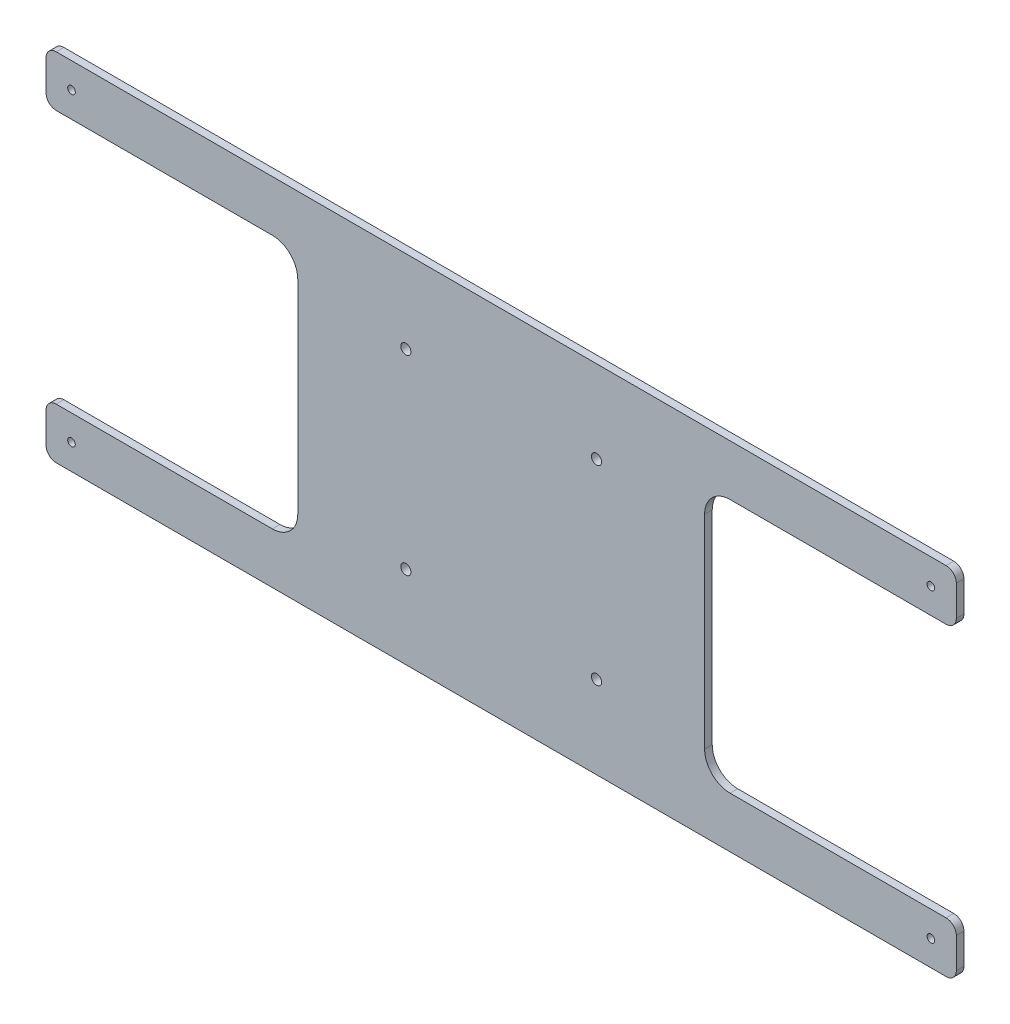
ISO-10303-21;
HEADER;
FILE_DESCRIPTION(('STEP AP214'),'2;1');
FILE_NAME('part.step','',(''),(''),'','','');
FILE_SCHEMA(('AUTOMOTIVE_DESIGN { 1 0 10303 214 1 1 1 1 }'));
ENDSEC;
DATA;
#1=APPLICATION_CONTEXT('core data for automotive mechanical design processes');
#2=APPLICATION_PROTOCOL_DEFINITION('international standard','automotive_design',2000,#1);
#3=PRODUCT_CONTEXT('',#1,'mechanical');
#4=PRODUCT('Part','Part','',(#3));
#5=PRODUCT_RELATED_PRODUCT_CATEGORY('part','',(#4));
#6=PRODUCT_DEFINITION_FORMATION('','',#4);
#7=PRODUCT_DEFINITION_CONTEXT('part definition',#1,'design');
#8=PRODUCT_DEFINITION('design','',#6,#7);
#9=PRODUCT_DEFINITION_SHAPE('','',#8);
#10=(LENGTH_UNIT() NAMED_UNIT(*) SI_UNIT(.MILLI.,.METRE.));
#11=(NAMED_UNIT(*) PLANE_ANGLE_UNIT() SI_UNIT($,.RADIAN.));
#12=(NAMED_UNIT(*) SI_UNIT($,.STERADIAN.) SOLID_ANGLE_UNIT());
#13=UNCERTAINTY_MEASURE_WITH_UNIT(LENGTH_MEASURE(1.E-05),#10,'distance_accuracy_value','');
#14=(GEOMETRIC_REPRESENTATION_CONTEXT(3) GLOBAL_UNCERTAINTY_ASSIGNED_CONTEXT((#13)) GLOBAL_UNIT_ASSIGNED_CONTEXT((#10,
#11,#12)) REPRESENTATION_CONTEXT('',''));
#15=CARTESIAN_POINT('',(0.,0.,0.));
#16=DIRECTION('',(0.,0.,1.));
#17=DIRECTION('',(1.,0.,0.));
#18=AXIS2_PLACEMENT_3D('',#15,#16,#17);
#19=CARTESIAN_POINT('',(0.,0.,3.));
#20=DIRECTION('',(0.,0.,1.));
#21=DIRECTION('',(1.,0.,0.));
#22=AXIS2_PLACEMENT_3D('',#19,#20,#21);
#23=PLANE('',#22);
#24=CARTESIAN_POINT('',(-37.5,-37.5,3.));
#25=DIRECTION('',(0.,0.,1.));
#26=DIRECTION('',(-1.,0.,0.));
#27=AXIS2_PLACEMENT_3D('',#24,#25,#26);
#28=CIRCLE('',#27,2.);
#29=CARTESIAN_POINT('',(-39.5,-37.5,3.));
#30=VERTEX_POINT('',#29);
#31=EDGE_CURVE('E447',#30,#30,#28,.T.);
#32=ORIENTED_EDGE('',*,*,#31,.F.);
#33=EDGE_LOOP('',(#32));
#34=FACE_BOUND('',#33,.T.);
#35=CARTESIAN_POINT('',(169.,-59.9999999999999,3.));
#36=DIRECTION('',(0.,0.,1.));
#37=DIRECTION('',(1.,0.,0.));
#38=AXIS2_PLACEMENT_3D('',#35,#36,#37);
#39=CIRCLE('',#38,1.5);
#40=CARTESIAN_POINT('',(170.5,-59.9999999999999,3.));
#41=VERTEX_POINT('',#40);
#42=EDGE_CURVE('E435',#41,#41,#39,.T.);
#43=ORIENTED_EDGE('',*,*,#42,.F.);
#44=EDGE_LOOP('',(#43));
#45=FACE_BOUND('',#44,.T.);
#46=CARTESIAN_POINT('',(37.5,37.5,3.));
#47=DIRECTION('',(0.,0.,1.));
#48=DIRECTION('',(-1.,0.,0.));
#49=AXIS2_PLACEMENT_3D('',#46,#47,#48);
#50=CIRCLE('',#49,2.);
#51=CARTESIAN_POINT('',(35.5,37.5,3.));
#52=VERTEX_POINT('',#51);
#53=EDGE_CURVE('E423',#52,#52,#50,.T.);
#54=ORIENTED_EDGE('',*,*,#53,.F.);
#55=EDGE_LOOP('',(#54));
#56=FACE_BOUND('',#55,.T.);
#57=CARTESIAN_POINT('',(-169.,60.,3.));
#58=DIRECTION('',(0.,0.,1.));
#59=DIRECTION('',(1.,0.,0.));
#60=AXIS2_PLACEMENT_3D('',#57,#58,#59);
#61=CIRCLE('',#60,1.5);
#62=CARTESIAN_POINT('',(-167.5,60.,3.));
#63=VERTEX_POINT('',#62);
#64=EDGE_CURVE('E376',#63,#63,#61,.T.);
#65=ORIENTED_EDGE('',*,*,#64,.F.);
#66=EDGE_LOOP('',(#65));
#67=FACE_BOUND('',#66,.T.);
#68=DIRECTION('',(1.,0.,0.));
#69=VECTOR('',#68,1.);
#70=CARTESIAN_POINT('',(-164.552800631142,-70.,3.));
#71=LINE('',#70,#69);
#72=CARTESIAN_POINT('',(-175.,-69.9999999999999,3.));
#73=VERTEX_POINT('',#72);
#74=CARTESIAN_POINT('',(175.,-70.000000000001,3.));
#75=VERTEX_POINT('',#74);
#76=EDGE_CURVE('E366',#73,#75,#71,.T.);
#77=ORIENTED_EDGE('',*,*,#76,.T.);
#78=CARTESIAN_POINT('',(175.,-65.9999999999999,3.));
#79=DIRECTION('',(0.,0.,1.));
#80=DIRECTION('',(1.,0.,0.));
#81=AXIS2_PLACEMENT_3D('',#78,#79,#80);
#82=CIRCLE('',#81,4.);
#83=CARTESIAN_POINT('',(179.,-65.9999999999999,3.));
#84=VERTEX_POINT('',#83);
#85=EDGE_CURVE('E273',#75,#84,#82,.T.);
#86=ORIENTED_EDGE('',*,*,#85,.T.);
#87=DIRECTION('',(0.,1.,0.));
#88=VECTOR('',#87,1.);
#89=CARTESIAN_POINT('',(179.,-69.9999999999999,3.));
#90=LINE('',#89,#88);
#91=CARTESIAN_POINT('',(179.,-53.9999999999999,3.));
#92=VERTEX_POINT('',#91);
#93=EDGE_CURVE('E214',#84,#92,#90,.T.);
#94=ORIENTED_EDGE('',*,*,#93,.T.);
#95=CARTESIAN_POINT('',(175.,-53.9999999999999,3.));
#96=DIRECTION('',(0.,0.,1.));
#97=DIRECTION('',(1.,0.,0.));
#98=AXIS2_PLACEMENT_3D('',#95,#96,#97);
#99=CIRCLE('',#98,4.);
#100=CARTESIAN_POINT('',(175.,-49.9999999999999,3.));
#101=VERTEX_POINT('',#100);
#102=EDGE_CURVE('E271',#92,#101,#99,.T.);
#103=ORIENTED_EDGE('',*,*,#102,.T.);
#104=DIRECTION('',(-1.,0.,0.));
#105=VECTOR('',#104,1.);
#106=CARTESIAN_POINT('',(179.,-49.9999999999999,3.));
#107=LINE('',#106,#105);
#108=CARTESIAN_POINT('',(90.,-49.9999999999999,3.));
#109=VERTEX_POINT('',#108);
#110=EDGE_CURVE('E361',#101,#109,#107,.T.);
#111=ORIENTED_EDGE('',*,*,#110,.T.);
#112=CARTESIAN_POINT('',(90.,-39.9999999999999,3.));
#113=DIRECTION('',(0.,0.,1.));
#114=DIRECTION('',(1.,0.,0.));
#115=AXIS2_PLACEMENT_3D('',#112,#113,#114);
#116=CIRCLE('',#115,10.);
#117=CARTESIAN_POINT('',(80.,-39.9999999999999,3.));
#118=VERTEX_POINT('',#117);
#119=EDGE_CURVE('E11',#109,#118,#116,.F.);
#120=ORIENTED_EDGE('',*,*,#119,.T.);
#121=DIRECTION('',(0.,1.,0.));
#122=VECTOR('',#121,1.);
#123=CARTESIAN_POINT('',(80.,49.9999999999999,3.));
#124=LINE('',#123,#122);
#125=CARTESIAN_POINT('',(80.,39.9999999999999,3.));
#126=VERTEX_POINT('',#125);
#127=EDGE_CURVE('E345',#118,#126,#124,.T.);
#128=ORIENTED_EDGE('',*,*,#127,.T.);
#129=CARTESIAN_POINT('',(90.,39.9999999999999,3.));
#130=DIRECTION('',(0.,0.,1.));
#131=DIRECTION('',(1.,0.,0.));
#132=AXIS2_PLACEMENT_3D('',#129,#130,#131);
#133=CIRCLE('',#132,10.);
#134=CARTESIAN_POINT('',(90.,49.9999999999999,3.));
#135=VERTEX_POINT('',#134);
#136=EDGE_CURVE('E336',#126,#135,#133,.F.);
#137=ORIENTED_EDGE('',*,*,#136,.T.);
#138=DIRECTION('',(1.,0.,0.));
#139=VECTOR('',#138,1.);
#140=CARTESIAN_POINT('',(179.,50.,3.));
#141=LINE('',#140,#139);
#142=CARTESIAN_POINT('',(175.,50.,3.));
#143=VERTEX_POINT('',#142);
#144=EDGE_CURVE('E343',#135,#143,#141,.T.);
#145=ORIENTED_EDGE('',*,*,#144,.T.);
#146=CARTESIAN_POINT('',(175.,54.,3.));
#147=DIRECTION('',(0.,0.,1.));
#148=DIRECTION('',(1.,0.,0.));
#149=AXIS2_PLACEMENT_3D('',#146,#147,#148);
#150=CIRCLE('',#149,4.);
#151=CARTESIAN_POINT('',(179.,54.,3.));
#152=VERTEX_POINT('',#151);
#153=EDGE_CURVE('E269',#143,#152,#150,.T.);
#154=ORIENTED_EDGE('',*,*,#153,.T.);
#155=DIRECTION('',(0.,1.,0.));
#156=VECTOR('',#155,1.);
#157=CARTESIAN_POINT('',(179.,70.,3.));
#158=LINE('',#157,#156);
#159=CARTESIAN_POINT('',(179.,66.,3.));
#160=VERTEX_POINT('',#159);
#161=EDGE_CURVE('E240',#152,#160,#158,.T.);
#162=ORIENTED_EDGE('',*,*,#161,.T.);
#163=CARTESIAN_POINT('',(175.,66.,3.));
#164=DIRECTION('',(0.,0.,1.));
#165=DIRECTION('',(1.,0.,0.));
#166=AXIS2_PLACEMENT_3D('',#163,#164,#165);
#167=CIRCLE('',#166,4.);
#168=CARTESIAN_POINT('',(175.,70.0000000000003,3.));
#169=VERTEX_POINT('',#168);
#170=EDGE_CURVE('E267',#160,#169,#167,.T.);
#171=ORIENTED_EDGE('',*,*,#170,.T.);
#172=DIRECTION('',(-1.,0.,0.));
#173=VECTOR('',#172,1.);
#174=CARTESIAN_POINT('',(-164.552800631142,70.,3.));
#175=LINE('',#174,#173);
#176=CARTESIAN_POINT('',(-175.,70.,3.));
#177=VERTEX_POINT('',#176);
#178=EDGE_CURVE('E239',#169,#177,#175,.T.);
#179=ORIENTED_EDGE('',*,*,#178,.T.);
#180=CARTESIAN_POINT('',(-175.,66.,3.));
#181=DIRECTION('',(0.,0.,1.));
#182=DIRECTION('',(1.,0.,0.));
#183=AXIS2_PLACEMENT_3D('',#180,#181,#182);
#184=CIRCLE('',#183,4.);
#185=CARTESIAN_POINT('',(-179.,66.,3.));
#186=VERTEX_POINT('',#185);
#187=EDGE_CURVE('E259',#177,#186,#184,.T.);
#188=ORIENTED_EDGE('',*,*,#187,.T.);
#189=DIRECTION('',(0.,-1.,0.));
#190=VECTOR('',#189,1.);
#191=CARTESIAN_POINT('',(-179.,70.,3.));
#192=LINE('',#191,#190);
#193=CARTESIAN_POINT('',(-179.,54.,3.));
#194=VERTEX_POINT('',#193);
#195=EDGE_CURVE('E409',#186,#194,#192,.T.);
#196=ORIENTED_EDGE('',*,*,#195,.T.);
#197=CARTESIAN_POINT('',(-175.,54.,3.));
#198=DIRECTION('',(0.,0.,1.));
#199=DIRECTION('',(1.,0.,0.));
#200=AXIS2_PLACEMENT_3D('',#197,#198,#199);
#201=CIRCLE('',#200,4.);
#202=CARTESIAN_POINT('',(-175.,50.,3.));
#203=VERTEX_POINT('',#202);
#204=EDGE_CURVE('E261',#194,#203,#201,.T.);
#205=ORIENTED_EDGE('',*,*,#204,.T.);
#206=DIRECTION('',(1.,0.,0.));
#207=VECTOR('',#206,1.);
#208=CARTESIAN_POINT('',(-179.,50.,3.));
#209=LINE('',#208,#207);
#210=CARTESIAN_POINT('',(-90.,49.9999999999999,3.));
#211=VERTEX_POINT('',#210);
#212=EDGE_CURVE('E406',#203,#211,#209,.T.);
#213=ORIENTED_EDGE('',*,*,#212,.T.);
#214=CARTESIAN_POINT('',(-90.,39.9999999999999,3.));
#215=DIRECTION('',(0.,0.,1.));
#216=DIRECTION('',(1.,0.,0.));
#217=AXIS2_PLACEMENT_3D('',#214,#215,#216);
#218=CIRCLE('',#217,10.);
#219=CARTESIAN_POINT('',(-80.,39.9999999999999,3.));
#220=VERTEX_POINT('',#219);
#221=EDGE_CURVE('E328',#211,#220,#218,.F.);
#222=ORIENTED_EDGE('',*,*,#221,.T.);
#223=DIRECTION('',(0.,-1.,0.));
#224=VECTOR('',#223,1.);
#225=CARTESIAN_POINT('',(-80.,49.9999999999999,3.));
#226=LINE('',#225,#224);
#227=CARTESIAN_POINT('',(-80.,-39.9999999999999,3.));
#228=VERTEX_POINT('',#227);
#229=EDGE_CURVE('E403',#220,#228,#226,.T.);
#230=ORIENTED_EDGE('',*,*,#229,.T.);
#231=CARTESIAN_POINT('',(-90.,-39.9999999999999,3.));
#232=DIRECTION('',(0.,0.,1.));
#233=DIRECTION('',(1.,0.,0.));
#234=AXIS2_PLACEMENT_3D('',#231,#232,#233);
#235=CIRCLE('',#234,10.);
#236=CARTESIAN_POINT('',(-90.,-49.9999999999999,3.));
#237=VERTEX_POINT('',#236);
#238=EDGE_CURVE('E332',#228,#237,#235,.F.);
#239=ORIENTED_EDGE('',*,*,#238,.T.);
#240=DIRECTION('',(-1.,0.,0.));
#241=VECTOR('',#240,1.);
#242=CARTESIAN_POINT('',(-179.,-49.9999999999999,3.));
#243=LINE('',#242,#241);
#244=CARTESIAN_POINT('',(-175.,-49.9999999999999,3.));
#245=VERTEX_POINT('',#244);
#246=EDGE_CURVE('E399',#237,#245,#243,.T.);
#247=ORIENTED_EDGE('',*,*,#246,.T.);
#248=CARTESIAN_POINT('',(-175.,-53.9999999999999,3.));
#249=DIRECTION('',(0.,0.,1.));
#250=DIRECTION('',(1.,0.,0.));
#251=AXIS2_PLACEMENT_3D('',#248,#249,#250);
#252=CIRCLE('',#251,4.);
#253=CARTESIAN_POINT('',(-179.,-53.9999999999999,3.));
#254=VERTEX_POINT('',#253);
#255=EDGE_CURVE('E263',#245,#254,#252,.T.);
#256=ORIENTED_EDGE('',*,*,#255,.T.);
#257=DIRECTION('',(0.,-1.,0.));
#258=VECTOR('',#257,1.);
#259=CARTESIAN_POINT('',(-179.,-69.9999999999999,3.));
#260=LINE('',#259,#258);
#261=CARTESIAN_POINT('',(-179.,-66.000000000001,3.));
#262=VERTEX_POINT('',#261);
#263=EDGE_CURVE('E396',#254,#262,#260,.T.);
#264=ORIENTED_EDGE('',*,*,#263,.T.);
#265=CARTESIAN_POINT('',(-175.,-66.000000000001,3.));
#266=DIRECTION('',(0.,0.,1.));
#267=DIRECTION('',(1.,0.,0.));
#268=AXIS2_PLACEMENT_3D('',#265,#266,#267);
#269=CIRCLE('',#268,4.);
#270=EDGE_CURVE('E265',#262,#73,#269,.T.);
#271=ORIENTED_EDGE('',*,*,#270,.T.);
#272=EDGE_LOOP('',(#77,#86,#94,#103,#111,#120,#128,#137,#145,#154,#162,#171,#179,#188,#196,#205,
#213,#222,#230,#239,#247,#256,#264,#271));
#273=FACE_BOUND('',#272,.T.);
#274=CARTESIAN_POINT('',(-37.5,37.5,3.));
#275=DIRECTION('',(0.,0.,1.));
#276=DIRECTION('',(1.,0.,0.));
#277=AXIS2_PLACEMENT_3D('',#274,#275,#276);
#278=CIRCLE('',#277,2.);
#279=CARTESIAN_POINT('',(-35.5,37.5,3.));
#280=VERTEX_POINT('',#279);
#281=EDGE_CURVE('E417',#280,#280,#278,.T.);
#282=ORIENTED_EDGE('',*,*,#281,.F.);
#283=EDGE_LOOP('',(#282));
#284=FACE_BOUND('',#283,.T.);
#285=CARTESIAN_POINT('',(169.,60.,3.));
#286=DIRECTION('',(0.,0.,1.));
#287=DIRECTION('',(-1.,0.,0.));
#288=AXIS2_PLACEMENT_3D('',#285,#286,#287);
#289=CIRCLE('',#288,1.5);
#290=CARTESIAN_POINT('',(167.5,60.,3.));
#291=VERTEX_POINT('',#290);
#292=EDGE_CURVE('E429',#291,#291,#289,.T.);
#293=ORIENTED_EDGE('',*,*,#292,.F.);
#294=EDGE_LOOP('',(#293));
#295=FACE_BOUND('',#294,.T.);
#296=CARTESIAN_POINT('',(37.5,-37.5,3.));
#297=DIRECTION('',(0.,0.,1.));
#298=DIRECTION('',(1.,0.,0.));
#299=AXIS2_PLACEMENT_3D('',#296,#297,#298);
#300=CIRCLE('',#299,2.);
#301=CARTESIAN_POINT('',(39.5,-37.5,3.));
#302=VERTEX_POINT('',#301);
#303=EDGE_CURVE('E441',#302,#302,#300,.T.);
#304=ORIENTED_EDGE('',*,*,#303,.F.);
#305=EDGE_LOOP('',(#304));
#306=FACE_BOUND('',#305,.T.);
#307=CARTESIAN_POINT('',(-169.,-60.,3.));
#308=DIRECTION('',(0.,0.,1.));
#309=DIRECTION('',(-1.,0.,0.));
#310=AXIS2_PLACEMENT_3D('',#307,#308,#309);
#311=CIRCLE('',#310,1.5);
#312=CARTESIAN_POINT('',(-170.5,-60.,3.));
#313=VERTEX_POINT('',#312);
#314=EDGE_CURVE('E453',#313,#313,#311,.T.);
#315=ORIENTED_EDGE('',*,*,#314,.F.);
#316=EDGE_LOOP('',(#315));
#317=FACE_BOUND('',#316,.T.);
#318=ADVANCED_FACE('F34',(#34,#45,#56,#67,#273,#284,#295,#306,#317),#23,.T.);
#319=CARTESIAN_POINT('',(0.,0.,0.));
#320=DIRECTION('',(0.,0.,1.));
#321=DIRECTION('',(1.,0.,0.));
#322=AXIS2_PLACEMENT_3D('',#319,#320,#321);
#323=PLANE('',#322);
#324=DIRECTION('',(0.,1.,0.));
#325=VECTOR('',#324,1.);
#326=CARTESIAN_POINT('',(179.,-69.9999999999999,0.));
#327=LINE('',#326,#325);
#328=CARTESIAN_POINT('',(179.,-65.9999999999999,0.));
#329=VERTEX_POINT('',#328);
#330=CARTESIAN_POINT('',(179.,-53.9999999999999,0.));
#331=VERTEX_POINT('',#330);
#332=EDGE_CURVE('E211',#329,#331,#327,.T.);
#333=ORIENTED_EDGE('',*,*,#332,.F.);
#334=CARTESIAN_POINT('',(175.,-65.9999999999999,0.));
#335=DIRECTION('',(0.,0.,1.));
#336=DIRECTION('',(1.,0.,0.));
#337=AXIS2_PLACEMENT_3D('',#334,#335,#336);
#338=CIRCLE('',#337,4.);
#339=CARTESIAN_POINT('',(175.,-69.9999999999999,0.));
#340=VERTEX_POINT('',#339);
#341=EDGE_CURVE('E195',#329,#340,#338,.F.);
#342=ORIENTED_EDGE('',*,*,#341,.T.);
#343=DIRECTION('',(1.,0.,0.));
#344=VECTOR('',#343,1.);
#345=CARTESIAN_POINT('',(164.552800631142,-70.,0.));
#346=LINE('',#345,#344);
#347=CARTESIAN_POINT('',(-175.,-70.000000000001,0.));
#348=VERTEX_POINT('',#347);
#349=EDGE_CURVE('E221',#348,#340,#346,.T.);
#350=ORIENTED_EDGE('',*,*,#349,.F.);
#351=CARTESIAN_POINT('',(-175.,-66.000000000001,0.));
#352=DIRECTION('',(0.,0.,1.));
#353=DIRECTION('',(1.,0.,0.));
#354=AXIS2_PLACEMENT_3D('',#351,#352,#353);
#355=CIRCLE('',#354,4.);
#356=CARTESIAN_POINT('',(-179.,-66.000000000001,0.));
#357=VERTEX_POINT('',#356);
#358=EDGE_CURVE('E248',#348,#357,#355,.F.);
#359=ORIENTED_EDGE('',*,*,#358,.T.);
#360=DIRECTION('',(0.,-1.,0.));
#361=VECTOR('',#360,1.);
#362=CARTESIAN_POINT('',(-179.,-69.9999999999999,0.));
#363=LINE('',#362,#361);
#364=CARTESIAN_POINT('',(-179.,-53.9999999999999,0.));
#365=VERTEX_POINT('',#364);
#366=EDGE_CURVE('E225',#365,#357,#363,.T.);
#367=ORIENTED_EDGE('',*,*,#366,.F.);
#368=CARTESIAN_POINT('',(-175.,-53.9999999999999,0.));
#369=DIRECTION('',(0.,0.,1.));
#370=DIRECTION('',(1.,0.,0.));
#371=AXIS2_PLACEMENT_3D('',#368,#369,#370);
#372=CIRCLE('',#371,4.);
#373=CARTESIAN_POINT('',(-175.,-49.9999999999999,0.));
#374=VERTEX_POINT('',#373);
#375=EDGE_CURVE('E245',#365,#374,#372,.F.);
#376=ORIENTED_EDGE('',*,*,#375,.T.);
#377=DIRECTION('',(-1.,0.,0.));
#378=VECTOR('',#377,1.);
#379=CARTESIAN_POINT('',(-179.,-49.9999999999999,0.));
#380=LINE('',#379,#378);
#381=CARTESIAN_POINT('',(-90.,-49.9999999999999,0.));
#382=VERTEX_POINT('',#381);
#383=EDGE_CURVE('E382',#382,#374,#380,.T.);
#384=ORIENTED_EDGE('',*,*,#383,.F.);
#385=CARTESIAN_POINT('',(-90.,-39.9999999999999,0.));
#386=DIRECTION('',(0.,0.,1.));
#387=DIRECTION('',(1.,0.,0.));
#388=AXIS2_PLACEMENT_3D('',#385,#386,#387);
#389=CIRCLE('',#388,10.);
#390=CARTESIAN_POINT('',(-80.,-39.9999999999999,0.));
#391=VERTEX_POINT('',#390);
#392=EDGE_CURVE('E330',#382,#391,#389,.T.);
#393=ORIENTED_EDGE('',*,*,#392,.T.);
#394=DIRECTION('',(0.,-1.,0.));
#395=VECTOR('',#394,1.);
#396=CARTESIAN_POINT('',(-80.,49.9999999999999,0.));
#397=LINE('',#396,#395);
#398=CARTESIAN_POINT('',(-80.,39.9999999999999,0.));
#399=VERTEX_POINT('',#398);
#400=EDGE_CURVE('E379',#399,#391,#397,.T.);
#401=ORIENTED_EDGE('',*,*,#400,.F.);
#402=CARTESIAN_POINT('',(-90.,39.9999999999999,0.));
#403=DIRECTION('',(0.,0.,1.));
#404=DIRECTION('',(1.,0.,0.));
#405=AXIS2_PLACEMENT_3D('',#402,#403,#404);
#406=CIRCLE('',#405,10.);
#407=CARTESIAN_POINT('',(-90.,49.9999999999999,0.));
#408=VERTEX_POINT('',#407);
#409=EDGE_CURVE('E326',#399,#408,#406,.T.);
#410=ORIENTED_EDGE('',*,*,#409,.T.);
#411=DIRECTION('',(1.,0.,0.));
#412=VECTOR('',#411,1.);
#413=CARTESIAN_POINT('',(-179.,50.,0.));
#414=LINE('',#413,#412);
#415=CARTESIAN_POINT('',(-175.,50.,0.));
#416=VERTEX_POINT('',#415);
#417=EDGE_CURVE('E375',#416,#408,#414,.T.);
#418=ORIENTED_EDGE('',*,*,#417,.F.);
#419=CARTESIAN_POINT('',(-175.,54.,0.));
#420=DIRECTION('',(0.,0.,1.));
#421=DIRECTION('',(1.,0.,0.));
#422=AXIS2_PLACEMENT_3D('',#419,#420,#421);
#423=CIRCLE('',#422,4.);
#424=CARTESIAN_POINT('',(-179.,54.,0.));
#425=VERTEX_POINT('',#424);
#426=EDGE_CURVE('E243',#416,#425,#423,.F.);
#427=ORIENTED_EDGE('',*,*,#426,.T.);
#428=DIRECTION('',(0.,-1.,0.));
#429=VECTOR('',#428,1.);
#430=CARTESIAN_POINT('',(-179.,70.,0.));
#431=LINE('',#430,#429);
#432=CARTESIAN_POINT('',(-179.,66.,0.));
#433=VERTEX_POINT('',#432);
#434=EDGE_CURVE('E372',#433,#425,#431,.T.);
#435=ORIENTED_EDGE('',*,*,#434,.F.);
#436=CARTESIAN_POINT('',(-175.,66.,0.));
#437=DIRECTION('',(0.,0.,1.));
#438=DIRECTION('',(1.,0.,0.));
#439=AXIS2_PLACEMENT_3D('',#436,#437,#438);
#440=CIRCLE('',#439,4.);
#441=CARTESIAN_POINT('',(-175.,70.,0.));
#442=VERTEX_POINT('',#441);
#443=EDGE_CURVE('E215',#433,#442,#440,.F.);
#444=ORIENTED_EDGE('',*,*,#443,.T.);
#445=DIRECTION('',(-1.,0.,0.));
#446=VECTOR('',#445,1.);
#447=CARTESIAN_POINT('',(-164.552800631142,70.,0.));
#448=LINE('',#447,#446);
#449=CARTESIAN_POINT('',(175.,70.,0.));
#450=VERTEX_POINT('',#449);
#451=EDGE_CURVE('E236',#450,#442,#448,.T.);
#452=ORIENTED_EDGE('',*,*,#451,.F.);
#453=CARTESIAN_POINT('',(175.,66.,0.));
#454=DIRECTION('',(0.,0.,1.));
#455=DIRECTION('',(1.,0.,0.));
#456=AXIS2_PLACEMENT_3D('',#453,#454,#455);
#457=CIRCLE('',#456,4.);
#458=CARTESIAN_POINT('',(179.,66.,0.));
#459=VERTEX_POINT('',#458);
#460=EDGE_CURVE('E250',#450,#459,#457,.F.);
#461=ORIENTED_EDGE('',*,*,#460,.T.);
#462=DIRECTION('',(0.,1.,0.));
#463=VECTOR('',#462,1.);
#464=CARTESIAN_POINT('',(179.,70.,0.));
#465=LINE('',#464,#463);
#466=CARTESIAN_POINT('',(179.,54.,0.));
#467=VERTEX_POINT('',#466);
#468=EDGE_CURVE('E233',#467,#459,#465,.T.);
#469=ORIENTED_EDGE('',*,*,#468,.F.);
#470=CARTESIAN_POINT('',(175.,54.,0.));
#471=DIRECTION('',(0.,0.,1.));
#472=DIRECTION('',(1.,0.,0.));
#473=AXIS2_PLACEMENT_3D('',#470,#471,#472);
#474=CIRCLE('',#473,4.);
#475=CARTESIAN_POINT('',(175.,50.,0.));
#476=VERTEX_POINT('',#475);
#477=EDGE_CURVE('E252',#467,#476,#474,.F.);
#478=ORIENTED_EDGE('',*,*,#477,.T.);
#479=DIRECTION('',(1.,0.,0.));
#480=VECTOR('',#479,1.);
#481=CARTESIAN_POINT('',(179.,50.,0.));
#482=LINE('',#481,#480);
#483=CARTESIAN_POINT('',(90.,49.9999999999999,0.));
#484=VERTEX_POINT('',#483);
#485=EDGE_CURVE('E231',#484,#476,#482,.T.);
#486=ORIENTED_EDGE('',*,*,#485,.F.);
#487=CARTESIAN_POINT('',(90.,39.9999999999999,0.));
#488=DIRECTION('',(0.,0.,1.));
#489=DIRECTION('',(1.,0.,0.));
#490=AXIS2_PLACEMENT_3D('',#487,#488,#489);
#491=CIRCLE('',#490,10.);
#492=CARTESIAN_POINT('',(80.,39.9999999999999,0.));
#493=VERTEX_POINT('',#492);
#494=EDGE_CURVE('E334',#484,#493,#491,.T.);
#495=ORIENTED_EDGE('',*,*,#494,.T.);
#496=DIRECTION('',(0.,1.,0.));
#497=VECTOR('',#496,1.);
#498=CARTESIAN_POINT('',(80.,49.9999999999999,0.));
#499=LINE('',#498,#497);
#500=CARTESIAN_POINT('',(80.,-39.9999999999999,0.));
#501=VERTEX_POINT('',#500);
#502=EDGE_CURVE('E223',#501,#493,#499,.T.);
#503=ORIENTED_EDGE('',*,*,#502,.F.);
#504=CARTESIAN_POINT('',(90.,-39.9999999999999,0.));
#505=DIRECTION('',(0.,0.,1.));
#506=DIRECTION('',(1.,0.,0.));
#507=AXIS2_PLACEMENT_3D('',#504,#505,#506);
#508=CIRCLE('',#507,10.);
#509=CARTESIAN_POINT('',(90.,-49.9999999999999,0.));
#510=VERTEX_POINT('',#509);
#511=EDGE_CURVE('E42',#501,#510,#508,.T.);
#512=ORIENTED_EDGE('',*,*,#511,.T.);
#513=DIRECTION('',(-1.,0.,0.));
#514=VECTOR('',#513,1.);
#515=CARTESIAN_POINT('',(179.,-49.9999999999999,0.));
#516=LINE('',#515,#514);
#517=CARTESIAN_POINT('',(175.,-49.9999999999999,0.));
#518=VERTEX_POINT('',#517);
#519=EDGE_CURVE('E220',#518,#510,#516,.T.);
#520=ORIENTED_EDGE('',*,*,#519,.F.);
#521=CARTESIAN_POINT('',(175.,-53.9999999999999,0.));
#522=DIRECTION('',(0.,0.,1.));
#523=DIRECTION('',(1.,0.,0.));
#524=AXIS2_PLACEMENT_3D('',#521,#522,#523);
#525=CIRCLE('',#524,4.);
#526=EDGE_CURVE('E205',#518,#331,#525,.F.);
#527=ORIENTED_EDGE('',*,*,#526,.T.);
#528=EDGE_LOOP('',(#333,#342,#350,#359,#367,#376,#384,#393,#401,#410,#418,#427,#435,#444,#452,
#461,#469,#478,#486,#495,#503,#512,#520,#527));
#529=FACE_BOUND('',#528,.T.);
#530=CARTESIAN_POINT('',(-169.,60.,0.));
#531=DIRECTION('',(0.,0.,1.));
#532=DIRECTION('',(1.,0.,0.));
#533=AXIS2_PLACEMENT_3D('',#530,#531,#532);
#534=CIRCLE('',#533,1.5);
#535=CARTESIAN_POINT('',(-167.5,60.,0.));
#536=VERTEX_POINT('',#535);
#537=EDGE_CURVE('E414',#536,#536,#534,.T.);
#538=ORIENTED_EDGE('',*,*,#537,.T.);
#539=EDGE_LOOP('',(#538));
#540=FACE_BOUND('',#539,.T.);
#541=CARTESIAN_POINT('',(-37.5,37.5,0.));
#542=DIRECTION('',(0.,0.,1.));
#543=DIRECTION('',(1.,0.,0.));
#544=AXIS2_PLACEMENT_3D('',#541,#542,#543);
#545=CIRCLE('',#544,2.);
#546=CARTESIAN_POINT('',(-35.5,37.5,0.));
#547=VERTEX_POINT('',#546);
#548=EDGE_CURVE('E420',#547,#547,#545,.T.);
#549=ORIENTED_EDGE('',*,*,#548,.T.);
#550=EDGE_LOOP('',(#549));
#551=FACE_BOUND('',#550,.T.);
#552=CARTESIAN_POINT('',(37.5,37.5,0.));
#553=DIRECTION('',(0.,0.,1.));
#554=DIRECTION('',(-1.,0.,0.));
#555=AXIS2_PLACEMENT_3D('',#552,#553,#554);
#556=CIRCLE('',#555,2.);
#557=CARTESIAN_POINT('',(35.5,37.5,0.));
#558=VERTEX_POINT('',#557);
#559=EDGE_CURVE('E426',#558,#558,#556,.T.);
#560=ORIENTED_EDGE('',*,*,#559,.T.);
#561=EDGE_LOOP('',(#560));
#562=FACE_BOUND('',#561,.T.);
#563=CARTESIAN_POINT('',(169.,60.,0.));
#564=DIRECTION('',(0.,0.,1.));
#565=DIRECTION('',(-1.,0.,0.));
#566=AXIS2_PLACEMENT_3D('',#563,#564,#565);
#567=CIRCLE('',#566,1.5);
#568=CARTESIAN_POINT('',(167.5,60.,0.));
#569=VERTEX_POINT('',#568);
#570=EDGE_CURVE('E432',#569,#569,#567,.T.);
#571=ORIENTED_EDGE('',*,*,#570,.T.);
#572=EDGE_LOOP('',(#571));
#573=FACE_BOUND('',#572,.T.);
#574=CARTESIAN_POINT('',(169.,-59.9999999999999,0.));
#575=DIRECTION('',(0.,0.,1.));
#576=DIRECTION('',(1.,0.,0.));
#577=AXIS2_PLACEMENT_3D('',#574,#575,#576);
#578=CIRCLE('',#577,1.5);
#579=CARTESIAN_POINT('',(170.5,-59.9999999999999,0.));
#580=VERTEX_POINT('',#579);
#581=EDGE_CURVE('E438',#580,#580,#578,.T.);
#582=ORIENTED_EDGE('',*,*,#581,.T.);
#583=EDGE_LOOP('',(#582));
#584=FACE_BOUND('',#583,.T.);
#585=CARTESIAN_POINT('',(37.5,-37.5,0.));
#586=DIRECTION('',(0.,0.,1.));
#587=DIRECTION('',(1.,0.,0.));
#588=AXIS2_PLACEMENT_3D('',#585,#586,#587);
#589=CIRCLE('',#588,2.);
#590=CARTESIAN_POINT('',(39.5,-37.5,0.));
#591=VERTEX_POINT('',#590);
#592=EDGE_CURVE('E444',#591,#591,#589,.T.);
#593=ORIENTED_EDGE('',*,*,#592,.T.);
#594=EDGE_LOOP('',(#593));
#595=FACE_BOUND('',#594,.T.);
#596=CARTESIAN_POINT('',(-37.5,-37.5,0.));
#597=DIRECTION('',(0.,0.,1.));
#598=DIRECTION('',(-1.,0.,0.));
#599=AXIS2_PLACEMENT_3D('',#596,#597,#598);
#600=CIRCLE('',#599,2.);
#601=CARTESIAN_POINT('',(-39.5,-37.5,0.));
#602=VERTEX_POINT('',#601);
#603=EDGE_CURVE('E450',#602,#602,#600,.T.);
#604=ORIENTED_EDGE('',*,*,#603,.T.);
#605=EDGE_LOOP('',(#604));
#606=FACE_BOUND('',#605,.T.);
#607=CARTESIAN_POINT('',(-169.,-60.,0.));
#608=DIRECTION('',(0.,0.,1.));
#609=DIRECTION('',(-1.,0.,0.));
#610=AXIS2_PLACEMENT_3D('',#607,#608,#609);
#611=CIRCLE('',#610,1.5);
#612=CARTESIAN_POINT('',(-170.5,-60.,0.));
#613=VERTEX_POINT('',#612);
#614=EDGE_CURVE('E456',#613,#613,#611,.T.);
#615=ORIENTED_EDGE('',*,*,#614,.T.);
#616=EDGE_LOOP('',(#615));
#617=FACE_BOUND('',#616,.T.);
#618=ADVANCED_FACE('F218',(#529,#540,#551,#562,#573,#584,#595,#606,#617),#323,.F.);
#619=CARTESIAN_POINT('',(-179.,70.,3.));
#620=DIRECTION('',(1.,0.,0.));
#621=DIRECTION('',(0.,0.,-1.));
#622=AXIS2_PLACEMENT_3D('',#619,#620,#621);
#623=PLANE('',#622);
#624=ORIENTED_EDGE('',*,*,#434,.T.);
#625=DIRECTION('',(0.,0.,-1.));
#626=VECTOR('',#625,1.);
#627=CARTESIAN_POINT('',(-179.,54.,3.));
#628=LINE('',#627,#626);
#629=EDGE_CURVE('E305',#425,#194,#628,.F.);
#630=ORIENTED_EDGE('',*,*,#629,.T.);
#631=ORIENTED_EDGE('',*,*,#195,.F.);
#632=DIRECTION('',(0.,0.,-1.));
#633=VECTOR('',#632,1.);
#634=CARTESIAN_POINT('',(-179.,66.,3.));
#635=LINE('',#634,#633);
#636=EDGE_CURVE('E302',#186,#433,#635,.T.);
#637=ORIENTED_EDGE('',*,*,#636,.T.);
#638=EDGE_LOOP('',(#624,#630,#631,#637));
#639=FACE_BOUND('',#638,.T.);
#640=ADVANCED_FACE('F471',(#639),#623,.F.);
#641=CARTESIAN_POINT('',(-179.,50.,3.));
#642=DIRECTION('',(0.,1.,0.));
#643=DIRECTION('',(-1.,0.,0.));
#644=AXIS2_PLACEMENT_3D('',#641,#642,#643);
#645=PLANE('',#644);
#646=ORIENTED_EDGE('',*,*,#417,.T.);
#647=DIRECTION('',(0.,0.,-1.));
#648=VECTOR('',#647,1.);
#649=CARTESIAN_POINT('',(-90.,49.9999999999999,3.));
#650=LINE('',#649,#648);
#651=EDGE_CURVE('E312',#408,#211,#650,.F.);
#652=ORIENTED_EDGE('',*,*,#651,.T.);
#653=ORIENTED_EDGE('',*,*,#212,.F.);
#654=DIRECTION('',(0.,0.,-1.));
#655=VECTOR('',#654,1.);
#656=CARTESIAN_POINT('',(-175.,50.,3.));
#657=LINE('',#656,#655);
#658=EDGE_CURVE('E299',#203,#416,#657,.T.);
#659=ORIENTED_EDGE('',*,*,#658,.T.);
#660=EDGE_LOOP('',(#646,#652,#653,#659));
#661=FACE_BOUND('',#660,.T.);
#662=ADVANCED_FACE('F507',(#661),#645,.F.);
#663=CARTESIAN_POINT('',(-80.,49.9999999999999,3.));
#664=DIRECTION('',(1.,0.,0.));
#665=DIRECTION('',(0.,1.,0.));
#666=AXIS2_PLACEMENT_3D('',#663,#664,#665);
#667=PLANE('',#666);
#668=ORIENTED_EDGE('',*,*,#229,.F.);
#669=DIRECTION('',(0.,0.,-1.));
#670=VECTOR('',#669,1.);
#671=CARTESIAN_POINT('',(-80.,39.9999999999999,0.));
#672=LINE('',#671,#670);
#673=EDGE_CURVE('E309',#220,#399,#672,.T.);
#674=ORIENTED_EDGE('',*,*,#673,.T.);
#675=ORIENTED_EDGE('',*,*,#400,.T.);
#676=DIRECTION('',(0.,0.,-1.));
#677=VECTOR('',#676,1.);
#678=CARTESIAN_POINT('',(-80.,-39.9999999999999,3.));
#679=LINE('',#678,#677);
#680=EDGE_CURVE('E307',#391,#228,#679,.F.);
#681=ORIENTED_EDGE('',*,*,#680,.T.);
#682=EDGE_LOOP('',(#668,#674,#675,#681));
#683=FACE_BOUND('',#682,.T.);
#684=ADVANCED_FACE('F503',(#683),#667,.F.);
#685=CARTESIAN_POINT('',(-179.,-49.9999999999999,3.));
#686=DIRECTION('',(0.,-1.,0.));
#687=DIRECTION('',(1.,0.,0.));
#688=AXIS2_PLACEMENT_3D('',#685,#686,#687);
#689=PLANE('',#688);
#690=ORIENTED_EDGE('',*,*,#246,.F.);
#691=DIRECTION('',(0.,0.,-1.));
#692=VECTOR('',#691,1.);
#693=CARTESIAN_POINT('',(-90.,-49.9999999999999,0.));
#694=LINE('',#693,#692);
#695=EDGE_CURVE('E314',#237,#382,#694,.T.);
#696=ORIENTED_EDGE('',*,*,#695,.T.);
#697=ORIENTED_EDGE('',*,*,#383,.T.);
#698=DIRECTION('',(0.,0.,-1.));
#699=VECTOR('',#698,1.);
#700=CARTESIAN_POINT('',(-175.,-49.9999999999999,3.));
#701=LINE('',#700,#699);
#702=EDGE_CURVE('E296',#374,#245,#701,.F.);
#703=ORIENTED_EDGE('',*,*,#702,.T.);
#704=EDGE_LOOP('',(#690,#696,#697,#703));
#705=FACE_BOUND('',#704,.T.);
#706=ADVANCED_FACE('F500',(#705),#689,.F.);
#707=CARTESIAN_POINT('',(-179.,-69.9999999999999,3.));
#708=DIRECTION('',(1.,0.,0.));
#709=DIRECTION('',(0.,1.,0.));
#710=AXIS2_PLACEMENT_3D('',#707,#708,#709);
#711=PLANE('',#710);
#712=ORIENTED_EDGE('',*,*,#366,.T.);
#713=DIRECTION('',(0.,0.,-1.));
#714=VECTOR('',#713,1.);
#715=CARTESIAN_POINT('',(-179.,-66.000000000001,3.));
#716=LINE('',#715,#714);
#717=EDGE_CURVE('E294',#357,#262,#716,.F.);
#718=ORIENTED_EDGE('',*,*,#717,.T.);
#719=ORIENTED_EDGE('',*,*,#263,.F.);
#720=DIRECTION('',(0.,0.,-1.));
#721=VECTOR('',#720,1.);
#722=CARTESIAN_POINT('',(-179.,-53.9999999999999,3.));
#723=LINE('',#722,#721);
#724=EDGE_CURVE('E291',#254,#365,#723,.T.);
#725=ORIENTED_EDGE('',*,*,#724,.T.);
#726=EDGE_LOOP('',(#712,#718,#719,#725));
#727=FACE_BOUND('',#726,.T.);
#728=ADVANCED_FACE('F387',(#727),#711,.F.);
#729=CARTESIAN_POINT('',(164.552800631142,-70.,3.));
#730=DIRECTION('',(0.,1.,0.));
#731=DIRECTION('',(-1.,0.,0.));
#732=AXIS2_PLACEMENT_3D('',#729,#730,#731);
#733=PLANE('',#732);
#734=ORIENTED_EDGE('',*,*,#349,.T.);
#735=DIRECTION('',(0.,0.,-1.));
#736=VECTOR('',#735,1.);
#737=CARTESIAN_POINT('',(175.,-69.9999999999999,3.));
#738=LINE('',#737,#736);
#739=EDGE_CURVE('E200',#340,#75,#738,.F.);
#740=ORIENTED_EDGE('',*,*,#739,.T.);
#741=ORIENTED_EDGE('',*,*,#76,.F.);
#742=DIRECTION('',(0.,0.,-1.));
#743=VECTOR('',#742,1.);
#744=CARTESIAN_POINT('',(-175.,-70.000000000001,3.));
#745=LINE('',#744,#743);
#746=EDGE_CURVE('E204',#73,#348,#745,.T.);
#747=ORIENTED_EDGE('',*,*,#746,.T.);
#748=EDGE_LOOP('',(#734,#740,#741,#747));
#749=FACE_BOUND('',#748,.T.);
#750=ADVANCED_FACE('F398',(#749),#733,.F.);
#751=CARTESIAN_POINT('',(179.,-69.9999999999999,3.));
#752=DIRECTION('',(-1.,0.,0.));
#753=DIRECTION('',(0.,-1.,0.));
#754=AXIS2_PLACEMENT_3D('',#751,#752,#753);
#755=PLANE('',#754);
#756=ORIENTED_EDGE('',*,*,#93,.F.);
#757=DIRECTION('',(0.,0.,-1.));
#758=VECTOR('',#757,1.);
#759=CARTESIAN_POINT('',(179.,-65.9999999999999,3.));
#760=LINE('',#759,#758);
#761=EDGE_CURVE('E199',#84,#329,#760,.T.);
#762=ORIENTED_EDGE('',*,*,#761,.T.);
#763=ORIENTED_EDGE('',*,*,#332,.T.);
#764=DIRECTION('',(0.,0.,-1.));
#765=VECTOR('',#764,1.);
#766=CARTESIAN_POINT('',(179.,-53.9999999999999,3.));
#767=LINE('',#766,#765);
#768=EDGE_CURVE('E216',#331,#92,#767,.F.);
#769=ORIENTED_EDGE('',*,*,#768,.T.);
#770=EDGE_LOOP('',(#756,#762,#763,#769));
#771=FACE_BOUND('',#770,.T.);
#772=ADVANCED_FACE('F210',(#771),#755,.F.);
#773=CARTESIAN_POINT('',(179.,-49.9999999999999,3.));
#774=DIRECTION('',(0.,-1.,0.));
#775=DIRECTION('',(1.,0.,0.));
#776=AXIS2_PLACEMENT_3D('',#773,#774,#775);
#777=PLANE('',#776);
#778=ORIENTED_EDGE('',*,*,#519,.T.);
#779=DIRECTION('',(0.,0.,-1.));
#780=VECTOR('',#779,1.);
#781=CARTESIAN_POINT('',(90.,-49.9999999999999,3.));
#782=LINE('',#781,#780);
#783=EDGE_CURVE('E55',#510,#109,#782,.F.);
#784=ORIENTED_EDGE('',*,*,#783,.T.);
#785=ORIENTED_EDGE('',*,*,#110,.F.);
#786=DIRECTION('',(0.,0.,-1.));
#787=VECTOR('',#786,1.);
#788=CARTESIAN_POINT('',(175.,-49.9999999999999,3.));
#789=LINE('',#788,#787);
#790=EDGE_CURVE('E275',#101,#518,#789,.T.);
#791=ORIENTED_EDGE('',*,*,#790,.T.);
#792=EDGE_LOOP('',(#778,#784,#785,#791));
#793=FACE_BOUND('',#792,.T.);
#794=ADVANCED_FACE('F491',(#793),#777,.F.);
#795=CARTESIAN_POINT('',(80.,49.9999999999999,3.));
#796=DIRECTION('',(-1.,0.,0.));
#797=DIRECTION('',(0.,-1.,0.));
#798=AXIS2_PLACEMENT_3D('',#795,#796,#797);
#799=PLANE('',#798);
#800=ORIENTED_EDGE('',*,*,#502,.T.);
#801=DIRECTION('',(0.,0.,-1.));
#802=VECTOR('',#801,1.);
#803=CARTESIAN_POINT('',(80.,39.9999999999999,3.));
#804=LINE('',#803,#802);
#805=EDGE_CURVE('E323',#493,#126,#804,.F.);
#806=ORIENTED_EDGE('',*,*,#805,.T.);
#807=ORIENTED_EDGE('',*,*,#127,.F.);
#808=DIRECTION('',(0.,0.,-1.));
#809=VECTOR('',#808,1.);
#810=CARTESIAN_POINT('',(80.,-39.9999999999999,0.));
#811=LINE('',#810,#809);
#812=EDGE_CURVE('E320',#118,#501,#811,.T.);
#813=ORIENTED_EDGE('',*,*,#812,.T.);
#814=EDGE_LOOP('',(#800,#806,#807,#813));
#815=FACE_BOUND('',#814,.T.);
#816=ADVANCED_FACE('F357',(#815),#799,.F.);
#817=CARTESIAN_POINT('',(179.,50.,3.));
#818=DIRECTION('',(0.,1.,0.));
#819=DIRECTION('',(-1.,0.,0.));
#820=AXIS2_PLACEMENT_3D('',#817,#818,#819);
#821=PLANE('',#820);
#822=ORIENTED_EDGE('',*,*,#144,.F.);
#823=DIRECTION('',(0.,0.,-1.));
#824=VECTOR('',#823,1.);
#825=CARTESIAN_POINT('',(90.,49.9999999999999,0.));
#826=LINE('',#825,#824);
#827=EDGE_CURVE('E317',#135,#484,#826,.T.);
#828=ORIENTED_EDGE('',*,*,#827,.T.);
#829=ORIENTED_EDGE('',*,*,#485,.T.);
#830=DIRECTION('',(0.,0.,-1.));
#831=VECTOR('',#830,1.);
#832=CARTESIAN_POINT('',(175.,50.,3.));
#833=LINE('',#832,#831);
#834=EDGE_CURVE('E283',#476,#143,#833,.F.);
#835=ORIENTED_EDGE('',*,*,#834,.T.);
#836=EDGE_LOOP('',(#822,#828,#829,#835));
#837=FACE_BOUND('',#836,.T.);
#838=ADVANCED_FACE('F350',(#837),#821,.F.);
#839=CARTESIAN_POINT('',(179.,70.,3.));
#840=DIRECTION('',(-1.,0.,0.));
#841=DIRECTION('',(0.,0.,1.));
#842=AXIS2_PLACEMENT_3D('',#839,#840,#841);
#843=PLANE('',#842);
#844=ORIENTED_EDGE('',*,*,#161,.F.);
#845=DIRECTION('',(0.,0.,-1.));
#846=VECTOR('',#845,1.);
#847=CARTESIAN_POINT('',(179.,54.,3.));
#848=LINE('',#847,#846);
#849=EDGE_CURVE('E280',#152,#467,#848,.T.);
#850=ORIENTED_EDGE('',*,*,#849,.T.);
#851=ORIENTED_EDGE('',*,*,#468,.T.);
#852=DIRECTION('',(0.,0.,-1.));
#853=VECTOR('',#852,1.);
#854=CARTESIAN_POINT('',(179.,66.,3.));
#855=LINE('',#854,#853);
#856=EDGE_CURVE('E278',#459,#160,#855,.F.);
#857=ORIENTED_EDGE('',*,*,#856,.T.);
#858=EDGE_LOOP('',(#844,#850,#851,#857));
#859=FACE_BOUND('',#858,.T.);
#860=ADVANCED_FACE('F482',(#859),#843,.F.);
#861=CARTESIAN_POINT('',(-164.552800631142,70.,3.));
#862=DIRECTION('',(0.,-1.,0.));
#863=DIRECTION('',(0.,0.,-1.));
#864=AXIS2_PLACEMENT_3D('',#861,#862,#863);
#865=PLANE('',#864);
#866=ORIENTED_EDGE('',*,*,#178,.F.);
#867=DIRECTION('',(0.,0.,-1.));
#868=VECTOR('',#867,1.);
#869=CARTESIAN_POINT('',(175.,70.,3.));
#870=LINE('',#869,#868);
#871=EDGE_CURVE('E288',#169,#450,#870,.T.);
#872=ORIENTED_EDGE('',*,*,#871,.T.);
#873=ORIENTED_EDGE('',*,*,#451,.T.);
#874=DIRECTION('',(0.,0.,-1.));
#875=VECTOR('',#874,1.);
#876=CARTESIAN_POINT('',(-175.,70.,3.));
#877=LINE('',#876,#875);
#878=EDGE_CURVE('E286',#442,#177,#877,.F.);
#879=ORIENTED_EDGE('',*,*,#878,.T.);
#880=EDGE_LOOP('',(#866,#872,#873,#879));
#881=FACE_BOUND('',#880,.T.);
#882=ADVANCED_FACE('F479',(#881),#865,.F.);
#883=CARTESIAN_POINT('',(-169.,60.,3.));
#884=DIRECTION('',(0.,0.,-1.));
#885=DIRECTION('',(-1.,0.,0.));
#886=AXIS2_PLACEMENT_3D('',#883,#884,#885);
#887=CYLINDRICAL_SURFACE('',#886,1.5);
#888=ORIENTED_EDGE('',*,*,#64,.T.);
#889=EDGE_LOOP('',(#888));
#890=FACE_BOUND('',#889,.T.);
#891=ORIENTED_EDGE('',*,*,#537,.F.);
#892=EDGE_LOOP('',(#891));
#893=FACE_BOUND('',#892,.T.);
#894=ADVANCED_FACE('F476',(#890,#893),#887,.F.);
#895=CARTESIAN_POINT('',(-37.5,37.5,3.));
#896=DIRECTION('',(0.,0.,-1.));
#897=DIRECTION('',(-1.,0.,0.));
#898=AXIS2_PLACEMENT_3D('',#895,#896,#897);
#899=CYLINDRICAL_SURFACE('',#898,2.);
#900=ORIENTED_EDGE('',*,*,#281,.T.);
#901=EDGE_LOOP('',(#900));
#902=FACE_BOUND('',#901,.T.);
#903=ORIENTED_EDGE('',*,*,#548,.F.);
#904=EDGE_LOOP('',(#903));
#905=FACE_BOUND('',#904,.T.);
#906=ADVANCED_FACE('F766',(#902,#905),#899,.F.);
#907=CARTESIAN_POINT('',(37.5,37.5,3.));
#908=DIRECTION('',(0.,0.,-1.));
#909=DIRECTION('',(-1.,0.,0.));
#910=AXIS2_PLACEMENT_3D('',#907,#908,#909);
#911=CYLINDRICAL_SURFACE('',#910,2.);
#912=ORIENTED_EDGE('',*,*,#53,.T.);
#913=EDGE_LOOP('',(#912));
#914=FACE_BOUND('',#913,.T.);
#915=ORIENTED_EDGE('',*,*,#559,.F.);
#916=EDGE_LOOP('',(#915));
#917=FACE_BOUND('',#916,.T.);
#918=ADVANCED_FACE('F756',(#914,#917),#911,.F.);
#919=CARTESIAN_POINT('',(169.,60.,3.));
#920=DIRECTION('',(0.,0.,-1.));
#921=DIRECTION('',(-1.,0.,0.));
#922=AXIS2_PLACEMENT_3D('',#919,#920,#921);
#923=CYLINDRICAL_SURFACE('',#922,1.5);
#924=ORIENTED_EDGE('',*,*,#292,.T.);
#925=EDGE_LOOP('',(#924));
#926=FACE_BOUND('',#925,.T.);
#927=ORIENTED_EDGE('',*,*,#570,.F.);
#928=EDGE_LOOP('',(#927));
#929=FACE_BOUND('',#928,.T.);
#930=ADVANCED_FACE('F746',(#926,#929),#923,.F.);
#931=CARTESIAN_POINT('',(169.,-59.9999999999999,3.));
#932=DIRECTION('',(0.,0.,-1.));
#933=DIRECTION('',(-1.,0.,0.));
#934=AXIS2_PLACEMENT_3D('',#931,#932,#933);
#935=CYLINDRICAL_SURFACE('',#934,1.5);
#936=ORIENTED_EDGE('',*,*,#42,.T.);
#937=EDGE_LOOP('',(#936));
#938=FACE_BOUND('',#937,.T.);
#939=ORIENTED_EDGE('',*,*,#581,.F.);
#940=EDGE_LOOP('',(#939));
#941=FACE_BOUND('',#940,.T.);
#942=ADVANCED_FACE('F736',(#938,#941),#935,.F.);
#943=CARTESIAN_POINT('',(37.5,-37.5,3.));
#944=DIRECTION('',(0.,0.,-1.));
#945=DIRECTION('',(-1.,0.,0.));
#946=AXIS2_PLACEMENT_3D('',#943,#944,#945);
#947=CYLINDRICAL_SURFACE('',#946,2.);
#948=ORIENTED_EDGE('',*,*,#303,.T.);
#949=EDGE_LOOP('',(#948));
#950=FACE_BOUND('',#949,.T.);
#951=ORIENTED_EDGE('',*,*,#592,.F.);
#952=EDGE_LOOP('',(#951));
#953=FACE_BOUND('',#952,.T.);
#954=ADVANCED_FACE('F726',(#950,#953),#947,.F.);
#955=CARTESIAN_POINT('',(-37.5,-37.5,3.));
#956=DIRECTION('',(0.,0.,-1.));
#957=DIRECTION('',(-1.,0.,0.));
#958=AXIS2_PLACEMENT_3D('',#955,#956,#957);
#959=CYLINDRICAL_SURFACE('',#958,2.);
#960=ORIENTED_EDGE('',*,*,#31,.T.);
#961=EDGE_LOOP('',(#960));
#962=FACE_BOUND('',#961,.T.);
#963=ORIENTED_EDGE('',*,*,#603,.F.);
#964=EDGE_LOOP('',(#963));
#965=FACE_BOUND('',#964,.T.);
#966=ADVANCED_FACE('F717',(#962,#965),#959,.F.);
#967=CARTESIAN_POINT('',(-169.,-60.,3.));
#968=DIRECTION('',(0.,0.,-1.));
#969=DIRECTION('',(-1.,0.,0.));
#970=AXIS2_PLACEMENT_3D('',#967,#968,#969);
#971=CYLINDRICAL_SURFACE('',#970,1.5);
#972=ORIENTED_EDGE('',*,*,#314,.T.);
#973=EDGE_LOOP('',(#972));
#974=FACE_BOUND('',#973,.T.);
#975=ORIENTED_EDGE('',*,*,#614,.F.);
#976=EDGE_LOOP('',(#975));
#977=FACE_BOUND('',#976,.T.);
#978=ADVANCED_FACE('F462',(#974,#977),#971,.F.);
#979=CARTESIAN_POINT('',(175.,-65.9999999999999,3.));
#980=DIRECTION('',(0.,0.,-1.));
#981=DIRECTION('',(-1.,0.,0.));
#982=AXIS2_PLACEMENT_3D('',#979,#980,#981);
#983=CYLINDRICAL_SURFACE('',#982,4.);
#984=ORIENTED_EDGE('',*,*,#85,.F.);
#985=ORIENTED_EDGE('',*,*,#739,.F.);
#986=ORIENTED_EDGE('',*,*,#341,.F.);
#987=ORIENTED_EDGE('',*,*,#761,.F.);
#988=EDGE_LOOP('',(#984,#985,#986,#987));
#989=FACE_BOUND('',#988,.T.);
#990=ADVANCED_FACE('F198',(#989),#983,.T.);
#991=CARTESIAN_POINT('',(175.,-53.9999999999999,3.));
#992=DIRECTION('',(0.,0.,-1.));
#993=DIRECTION('',(-1.,0.,0.));
#994=AXIS2_PLACEMENT_3D('',#991,#992,#993);
#995=CYLINDRICAL_SURFACE('',#994,4.);
#996=ORIENTED_EDGE('',*,*,#102,.F.);
#997=ORIENTED_EDGE('',*,*,#768,.F.);
#998=ORIENTED_EDGE('',*,*,#526,.F.);
#999=ORIENTED_EDGE('',*,*,#790,.F.);
#1000=EDGE_LOOP('',(#996,#997,#998,#999));
#1001=FACE_BOUND('',#1000,.T.);
#1002=ADVANCED_FACE('F517',(#1001),#995,.T.);
#1003=CARTESIAN_POINT('',(175.,54.,3.));
#1004=DIRECTION('',(0.,0.,-1.));
#1005=DIRECTION('',(-1.,0.,0.));
#1006=AXIS2_PLACEMENT_3D('',#1003,#1004,#1005);
#1007=CYLINDRICAL_SURFACE('',#1006,4.);
#1008=ORIENTED_EDGE('',*,*,#153,.F.);
#1009=ORIENTED_EDGE('',*,*,#834,.F.);
#1010=ORIENTED_EDGE('',*,*,#477,.F.);
#1011=ORIENTED_EDGE('',*,*,#849,.F.);
#1012=EDGE_LOOP('',(#1008,#1009,#1010,#1011));
#1013=FACE_BOUND('',#1012,.T.);
#1014=ADVANCED_FACE('F520',(#1013),#1007,.T.);
#1015=CARTESIAN_POINT('',(175.,66.,3.));
#1016=DIRECTION('',(0.,0.,-1.));
#1017=DIRECTION('',(-1.,0.,0.));
#1018=AXIS2_PLACEMENT_3D('',#1015,#1016,#1017);
#1019=CYLINDRICAL_SURFACE('',#1018,4.);
#1020=ORIENTED_EDGE('',*,*,#170,.F.);
#1021=ORIENTED_EDGE('',*,*,#856,.F.);
#1022=ORIENTED_EDGE('',*,*,#460,.F.);
#1023=ORIENTED_EDGE('',*,*,#871,.F.);
#1024=EDGE_LOOP('',(#1020,#1021,#1022,#1023));
#1025=FACE_BOUND('',#1024,.T.);
#1026=ADVANCED_FACE('F524',(#1025),#1019,.T.);
#1027=CARTESIAN_POINT('',(-175.,-66.000000000001,3.));
#1028=DIRECTION('',(0.,0.,-1.));
#1029=DIRECTION('',(-1.,0.,0.));
#1030=AXIS2_PLACEMENT_3D('',#1027,#1028,#1029);
#1031=CYLINDRICAL_SURFACE('',#1030,4.);
#1032=ORIENTED_EDGE('',*,*,#270,.F.);
#1033=ORIENTED_EDGE('',*,*,#717,.F.);
#1034=ORIENTED_EDGE('',*,*,#358,.F.);
#1035=ORIENTED_EDGE('',*,*,#746,.F.);
#1036=EDGE_LOOP('',(#1032,#1033,#1034,#1035));
#1037=FACE_BOUND('',#1036,.T.);
#1038=ADVANCED_FACE('F393',(#1037),#1031,.T.);
#1039=CARTESIAN_POINT('',(-175.,-53.9999999999999,3.));
#1040=DIRECTION('',(0.,0.,-1.));
#1041=DIRECTION('',(-1.,0.,0.));
#1042=AXIS2_PLACEMENT_3D('',#1039,#1040,#1041);
#1043=CYLINDRICAL_SURFACE('',#1042,4.);
#1044=ORIENTED_EDGE('',*,*,#255,.F.);
#1045=ORIENTED_EDGE('',*,*,#702,.F.);
#1046=ORIENTED_EDGE('',*,*,#375,.F.);
#1047=ORIENTED_EDGE('',*,*,#724,.F.);
#1048=EDGE_LOOP('',(#1044,#1045,#1046,#1047));
#1049=FACE_BOUND('',#1048,.T.);
#1050=ADVANCED_FACE('F531',(#1049),#1043,.T.);
#1051=CARTESIAN_POINT('',(-175.,54.,3.));
#1052=DIRECTION('',(0.,0.,-1.));
#1053=DIRECTION('',(-1.,0.,0.));
#1054=AXIS2_PLACEMENT_3D('',#1051,#1052,#1053);
#1055=CYLINDRICAL_SURFACE('',#1054,4.);
#1056=ORIENTED_EDGE('',*,*,#204,.F.);
#1057=ORIENTED_EDGE('',*,*,#629,.F.);
#1058=ORIENTED_EDGE('',*,*,#426,.F.);
#1059=ORIENTED_EDGE('',*,*,#658,.F.);
#1060=EDGE_LOOP('',(#1056,#1057,#1058,#1059));
#1061=FACE_BOUND('',#1060,.T.);
#1062=ADVANCED_FACE('F534',(#1061),#1055,.T.);
#1063=CARTESIAN_POINT('',(-175.,66.,3.));
#1064=DIRECTION('',(0.,0.,-1.));
#1065=DIRECTION('',(-1.,0.,0.));
#1066=AXIS2_PLACEMENT_3D('',#1063,#1064,#1065);
#1067=CYLINDRICAL_SURFACE('',#1066,4.);
#1068=ORIENTED_EDGE('',*,*,#187,.F.);
#1069=ORIENTED_EDGE('',*,*,#878,.F.);
#1070=ORIENTED_EDGE('',*,*,#443,.F.);
#1071=ORIENTED_EDGE('',*,*,#636,.F.);
#1072=EDGE_LOOP('',(#1068,#1069,#1070,#1071));
#1073=FACE_BOUND('',#1072,.T.);
#1074=ADVANCED_FACE('F538',(#1073),#1067,.T.);
#1075=CARTESIAN_POINT('',(-90.,39.9999999999999,3.));
#1076=DIRECTION('',(0.,0.,1.));
#1077=DIRECTION('',(1.,0.,0.));
#1078=AXIS2_PLACEMENT_3D('',#1075,#1076,#1077);
#1079=CYLINDRICAL_SURFACE('',#1078,10.);
#1080=ORIENTED_EDGE('',*,*,#221,.F.);
#1081=ORIENTED_EDGE('',*,*,#651,.F.);
#1082=ORIENTED_EDGE('',*,*,#409,.F.);
#1083=ORIENTED_EDGE('',*,*,#673,.F.);
#1084=EDGE_LOOP('',(#1080,#1081,#1082,#1083));
#1085=FACE_BOUND('',#1084,.T.);
#1086=ADVANCED_FACE('F542',(#1085),#1079,.F.);
#1087=CARTESIAN_POINT('',(-90.,-39.9999999999999,3.));
#1088=DIRECTION('',(0.,0.,1.));
#1089=DIRECTION('',(1.,0.,0.));
#1090=AXIS2_PLACEMENT_3D('',#1087,#1088,#1089);
#1091=CYLINDRICAL_SURFACE('',#1090,10.);
#1092=ORIENTED_EDGE('',*,*,#238,.F.);
#1093=ORIENTED_EDGE('',*,*,#680,.F.);
#1094=ORIENTED_EDGE('',*,*,#392,.F.);
#1095=ORIENTED_EDGE('',*,*,#695,.F.);
#1096=EDGE_LOOP('',(#1092,#1093,#1094,#1095));
#1097=FACE_BOUND('',#1096,.T.);
#1098=ADVANCED_FACE('F546',(#1097),#1091,.F.);
#1099=CARTESIAN_POINT('',(90.,39.9999999999999,3.));
#1100=DIRECTION('',(0.,0.,1.));
#1101=DIRECTION('',(1.,0.,0.));
#1102=AXIS2_PLACEMENT_3D('',#1099,#1100,#1101);
#1103=CYLINDRICAL_SURFACE('',#1102,10.);
#1104=ORIENTED_EDGE('',*,*,#136,.F.);
#1105=ORIENTED_EDGE('',*,*,#805,.F.);
#1106=ORIENTED_EDGE('',*,*,#494,.F.);
#1107=ORIENTED_EDGE('',*,*,#827,.F.);
#1108=EDGE_LOOP('',(#1104,#1105,#1106,#1107));
#1109=FACE_BOUND('',#1108,.T.);
#1110=ADVANCED_FACE('F355',(#1109),#1103,.F.);
#1111=CARTESIAN_POINT('',(90.,-39.9999999999999,3.));
#1112=DIRECTION('',(0.,0.,1.));
#1113=DIRECTION('',(1.,0.,0.));
#1114=AXIS2_PLACEMENT_3D('',#1111,#1112,#1113);
#1115=CYLINDRICAL_SURFACE('',#1114,10.);
#1116=ORIENTED_EDGE('',*,*,#119,.F.);
#1117=ORIENTED_EDGE('',*,*,#783,.F.);
#1118=ORIENTED_EDGE('',*,*,#511,.F.);
#1119=ORIENTED_EDGE('',*,*,#812,.F.);
#1120=EDGE_LOOP('',(#1116,#1117,#1118,#1119));
#1121=FACE_BOUND('',#1120,.T.);
#1122=ADVANCED_FACE('F36',(#1121),#1115,.F.);
#1123=CLOSED_SHELL('',(#318,#618,#640,#662,#684,#706,#728,#750,#772,#794,#816,#838,#860,#882,
#894,#906,#918,#930,#942,#954,#966,#978,#990,#1002,#1014,#1026,#1038,#1050,#1062,#1074,#1086,
#1098,#1110,#1122));
#1124=MANIFOLD_SOLID_BREP('B2',#1123);
#1125=ADVANCED_BREP_SHAPE_REPRESENTATION('',(#18,#1124),#14);
#1126=SHAPE_DEFINITION_REPRESENTATION(#9,#1125);
ENDSEC;
END-ISO-10303-21;
